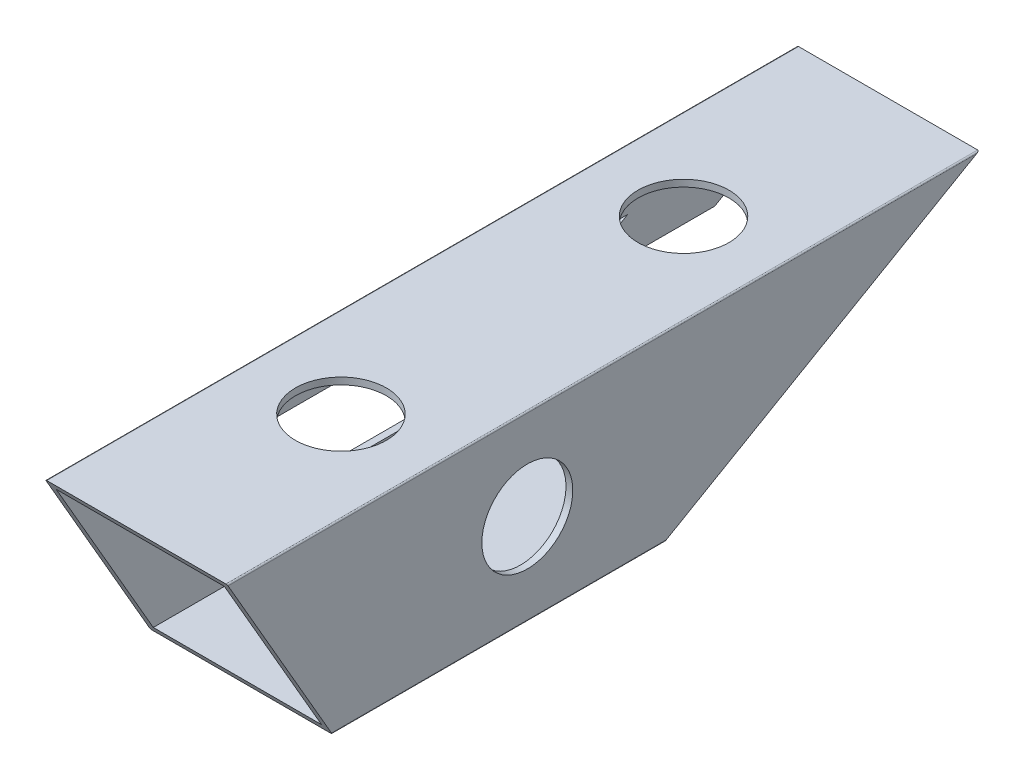
ISO-10303-21;
HEADER;
FILE_DESCRIPTION(('STEP AP214'),'2;1');
FILE_NAME('part.step','',(''),(''),'','','');
FILE_SCHEMA(('AUTOMOTIVE_DESIGN { 1 0 10303 214 1 1 1 1 }'));
ENDSEC;
DATA;
#1=APPLICATION_CONTEXT('core data for automotive mechanical design processes');
#2=APPLICATION_PROTOCOL_DEFINITION('international standard','automotive_design',2000,#1);
#3=PRODUCT_CONTEXT('',#1,'mechanical');
#4=PRODUCT('Part','Part','',(#3));
#5=PRODUCT_RELATED_PRODUCT_CATEGORY('part','',(#4));
#6=PRODUCT_DEFINITION_FORMATION('','',#4);
#7=PRODUCT_DEFINITION_CONTEXT('part definition',#1,'design');
#8=PRODUCT_DEFINITION('design','',#6,#7);
#9=PRODUCT_DEFINITION_SHAPE('','',#8);
#10=(LENGTH_UNIT() NAMED_UNIT(*) SI_UNIT(.MILLI.,.METRE.));
#11=(NAMED_UNIT(*) PLANE_ANGLE_UNIT() SI_UNIT($,.RADIAN.));
#12=(NAMED_UNIT(*) SI_UNIT($,.STERADIAN.) SOLID_ANGLE_UNIT());
#13=UNCERTAINTY_MEASURE_WITH_UNIT(LENGTH_MEASURE(1.E-05),#10,'distance_accuracy_value','');
#14=(GEOMETRIC_REPRESENTATION_CONTEXT(3) GLOBAL_UNCERTAINTY_ASSIGNED_CONTEXT((#13)) GLOBAL_UNIT_ASSIGNED_CONTEXT((#10,
#11,#12)) REPRESENTATION_CONTEXT('',''));
#15=CARTESIAN_POINT('',(0.,0.,0.));
#16=DIRECTION('',(0.,0.,1.));
#17=DIRECTION('',(1.,0.,0.));
#18=AXIS2_PLACEMENT_3D('',#15,#16,#17);
#19=CARTESIAN_POINT('',(1.5,1.5,165.35));
#20=DIRECTION('',(1.,0.,0.));
#21=DIRECTION('',(0.,0.,-1.));
#22=AXIS2_PLACEMENT_3D('',#19,#20,#21);
#23=PLANE('',#22);
#24=DIRECTION('',(0.,-0.500000000000004,0.866025403784436));
#25=VECTOR('',#24,1.);
#26=CARTESIAN_POINT('',(1.5,-41.223650257879,140.68348902285));
#27=LINE('',#26,#25);
#28=CARTESIAN_POINT('',(1.5,38.5,2.59807621135327));
#29=VERTEX_POINT('',#28);
#30=CARTESIAN_POINT('',(1.5,30.0000000000004,17.3205080756879));
#31=VERTEX_POINT('',#30);
#32=EDGE_CURVE('E333',#29,#31,#27,.T.);
#33=ORIENTED_EDGE('',*,*,#32,.F.);
#34=DIRECTION('',(0.,0.,-1.));
#35=VECTOR('',#34,1.);
#36=CARTESIAN_POINT('',(1.5,38.5,165.35));
#37=LINE('',#36,#35);
#38=CARTESIAN_POINT('',(1.5,38.5,164.483974596216));
#39=VERTEX_POINT('',#38);
#40=EDGE_CURVE('E352',#39,#29,#37,.T.);
#41=ORIENTED_EDGE('',*,*,#40,.F.);
#42=DIRECTION('',(0.,0.866025403784442,0.499999999999995));
#43=VECTOR('',#42,1.);
#44=CARTESIAN_POINT('',(1.5,11.1249999999998,148.67901097715));
#45=LINE('',#44,#43);
#46=CARTESIAN_POINT('',(1.5,1.5,143.1220146362));
#47=VERTEX_POINT('',#46);
#48=EDGE_CURVE('E309',#47,#39,#45,.T.);
#49=ORIENTED_EDGE('',*,*,#48,.F.);
#50=DIRECTION('',(0.,0.,-1.));
#51=VECTOR('',#50,1.);
#52=CARTESIAN_POINT('',(1.5,1.5,165.35));
#53=LINE('',#52,#51);
#54=CARTESIAN_POINT('',(1.5,1.5,66.683956091401));
#55=VERTEX_POINT('',#54);
#56=EDGE_CURVE('E361',#47,#55,#53,.T.);
#57=ORIENTED_EDGE('',*,*,#56,.T.);
#58=CARTESIAN_POINT('',(1.5,20.,34.6410161513772));
#59=VERTEX_POINT('',#58);
#60=EDGE_CURVE('E332',#59,#55,#27,.T.);
#61=ORIENTED_EDGE('',*,*,#60,.F.);
#62=DIRECTION('',(0.,0.,1.));
#63=VECTOR('',#62,1.);
#64=CARTESIAN_POINT('',(1.5,20.0000000000003,19.641016151377));
#65=LINE('',#64,#63);
#66=CARTESIAN_POINT('',(1.5,20.0000000000003,19.641016151377));
#67=VERTEX_POINT('',#66);
#68=EDGE_CURVE('E250',#67,#59,#65,.T.);
#69=ORIENTED_EDGE('',*,*,#68,.F.);
#70=DIRECTION('',(0.,-0.5,0.866025403784439));
#71=VECTOR('',#70,1.);
#72=CARTESIAN_POINT('',(1.5,30.0000000000004,2.32050807568812));
#73=LINE('',#72,#71);
#74=CARTESIAN_POINT('',(1.5,30.0000000000004,2.32050807568812));
#75=VERTEX_POINT('',#74);
#76=EDGE_CURVE('E246',#75,#67,#73,.T.);
#77=ORIENTED_EDGE('',*,*,#76,.F.);
#78=DIRECTION('',(0.,0.,-1.));
#79=VECTOR('',#78,1.);
#80=CARTESIAN_POINT('',(1.5,30.0000000000004,17.3205080756879));
#81=LINE('',#80,#79);
#82=EDGE_CURVE('E243',#31,#75,#81,.T.);
#83=ORIENTED_EDGE('',*,*,#82,.F.);
#84=EDGE_LOOP('',(#33,#41,#49,#57,#61,#69,#77,#83));
#85=FACE_BOUND('',#84,.T.);
#86=DIRECTION('',(0.,0.866025403784439,0.5));
#87=VECTOR('',#86,1.);
#88=CARTESIAN_POINT('',(1.5,18.6249999999999,135.688629920383));
#89=LINE('',#88,#87);
#90=CARTESIAN_POINT('',(1.5,12.,131.863684387002));
#91=VERTEX_POINT('',#90);
#92=CARTESIAN_POINT('',(1.5,28.,141.101288694036));
#93=VERTEX_POINT('',#92);
#94=EDGE_CURVE('E239',#91,#93,#89,.T.);
#95=ORIENTED_EDGE('',*,*,#94,.T.);
#96=DIRECTION('',(0.,0.,-1.));
#97=VECTOR('',#96,1.);
#98=CARTESIAN_POINT('',(1.5,28.,165.35));
#99=LINE('',#98,#97);
#100=CARTESIAN_POINT('',(1.5,28.,38.7846096908265));
#101=VERTEX_POINT('',#100);
#102=EDGE_CURVE('E203',#93,#101,#99,.T.);
#103=ORIENTED_EDGE('',*,*,#102,.T.);
#104=DIRECTION('',(0.,-0.5,0.866025403784439));
#105=VECTOR('',#104,1.);
#106=CARTESIAN_POINT('',(1.5,-33.4294216238185,145.18348902285));
#107=LINE('',#106,#105);
#108=CARTESIAN_POINT('',(1.5,12.,66.4974226119286));
#109=VERTEX_POINT('',#108);
#110=EDGE_CURVE('E206',#101,#109,#107,.T.);
#111=ORIENTED_EDGE('',*,*,#110,.T.);
#112=DIRECTION('',(0.,0.,1.));
#113=VECTOR('',#112,1.);
#114=CARTESIAN_POINT('',(1.5,12.,165.35));
#115=LINE('',#114,#113);
#116=EDGE_CURVE('E236',#109,#91,#115,.T.);
#117=ORIENTED_EDGE('',*,*,#116,.T.);
#118=EDGE_LOOP('',(#95,#103,#111,#117));
#119=FACE_BOUND('',#118,.T.);
#120=ADVANCED_FACE('F39',(#85,#119),#23,.T.);
#121=CARTESIAN_POINT('',(0.,0.305025041444909,165.35));
#122=DIRECTION('',(1.,0.,0.));
#123=DIRECTION('',(0.,0.,-1.));
#124=AXIS2_PLACEMENT_3D('',#121,#122,#123);
#125=PLANE('',#124);
#126=DIRECTION('',(0.,0.,-1.));
#127=VECTOR('',#126,1.);
#128=CARTESIAN_POINT('',(0.,39.6949749585551,165.35));
#129=LINE('',#128,#127);
#130=CARTESIAN_POINT('',(0.,39.6949749585551,165.173893710212));
#131=VERTEX_POINT('',#130);
#132=CARTESIAN_POINT('',(0.,39.6949749585551,0.528318869363359));
#133=VERTEX_POINT('',#132);
#134=EDGE_CURVE('E390',#131,#133,#129,.T.);
#135=ORIENTED_EDGE('',*,*,#134,.T.);
#136=DIRECTION('',(0.,-0.500000000000004,0.866025403784436));
#137=VECTOR('',#136,1.);
#138=CARTESIAN_POINT('',(0.,-41.5223939975178,141.200928358347));
#139=LINE('',#138,#137);
#140=CARTESIAN_POINT('',(0.,30.0000000000004,17.3205080756879));
#141=VERTEX_POINT('',#140);
#142=EDGE_CURVE('E346',#133,#141,#139,.T.);
#143=ORIENTED_EDGE('',*,*,#142,.T.);
#144=DIRECTION('',(0.,0.,-1.));
#145=VECTOR('',#144,1.);
#146=CARTESIAN_POINT('',(0.,30.0000000000004,17.3205080756879));
#147=LINE('',#146,#145);
#148=CARTESIAN_POINT('',(0.,30.0000000000004,2.32050807568812));
#149=VERTEX_POINT('',#148);
#150=EDGE_CURVE('E242',#141,#149,#147,.T.);
#151=ORIENTED_EDGE('',*,*,#150,.T.);
#152=DIRECTION('',(0.,-0.5,0.866025403784439));
#153=VECTOR('',#152,1.);
#154=CARTESIAN_POINT('',(0.,30.0000000000004,2.32050807568812));
#155=LINE('',#154,#153);
#156=CARTESIAN_POINT('',(0.,20.0000000000003,19.641016151377));
#157=VERTEX_POINT('',#156);
#158=EDGE_CURVE('E255',#149,#157,#155,.T.);
#159=ORIENTED_EDGE('',*,*,#158,.T.);
#160=DIRECTION('',(0.,0.,1.));
#161=VECTOR('',#160,1.);
#162=CARTESIAN_POINT('',(0.,20.0000000000003,19.641016151377));
#163=LINE('',#162,#161);
#164=CARTESIAN_POINT('',(0.,20.,34.6410161513772));
#165=VERTEX_POINT('',#164);
#166=EDGE_CURVE('E247',#157,#165,#163,.T.);
#167=ORIENTED_EDGE('',*,*,#166,.T.);
#168=CARTESIAN_POINT('',(0.,0.305025041444909,68.753713433391));
#169=VERTEX_POINT('',#168);
#170=EDGE_CURVE('E345',#165,#169,#139,.T.);
#171=ORIENTED_EDGE('',*,*,#170,.T.);
#172=DIRECTION('',(0.,0.,-1.));
#173=VECTOR('',#172,1.);
#174=CARTESIAN_POINT('',(0.,0.305025041444909,165.35));
#175=LINE('',#174,#173);
#176=CARTESIAN_POINT('',(0.,0.305025041444909,142.432095522203));
#177=VERTEX_POINT('',#176);
#178=EDGE_CURVE('E387',#177,#169,#175,.T.);
#179=ORIENTED_EDGE('',*,*,#178,.F.);
#180=DIRECTION('',(0.,0.866025403784442,0.499999999999995));
#181=VECTOR('',#180,1.);
#182=CARTESIAN_POINT('',(0.,10.2287687810835,148.161571641652));
#183=LINE('',#182,#181);
#184=EDGE_CURVE('E320',#177,#131,#183,.T.);
#185=ORIENTED_EDGE('',*,*,#184,.T.);
#186=EDGE_LOOP('',(#135,#143,#151,#159,#167,#171,#179,#185));
#187=FACE_BOUND('',#186,.T.);
#188=DIRECTION('',(0.,0.,1.));
#189=VECTOR('',#188,1.);
#190=CARTESIAN_POINT('',(0.,28.,141.101288694036));
#191=LINE('',#190,#189);
#192=CARTESIAN_POINT('',(0.,28.,38.7846096908265));
#193=VERTEX_POINT('',#192);
#194=CARTESIAN_POINT('',(0.,28.,141.101288694036));
#195=VERTEX_POINT('',#194);
#196=EDGE_CURVE('E63',#193,#195,#191,.T.);
#197=ORIENTED_EDGE('',*,*,#196,.T.);
#198=DIRECTION('',(0.,-0.866025403784438,-0.5));
#199=VECTOR('',#198,1.);
#200=CARTESIAN_POINT('',(0.,12.,131.863684387002));
#201=LINE('',#200,#199);
#202=CARTESIAN_POINT('',(0.,12.,131.863684387002));
#203=VERTEX_POINT('',#202);
#204=EDGE_CURVE('E210',#195,#203,#201,.T.);
#205=ORIENTED_EDGE('',*,*,#204,.T.);
#206=DIRECTION('',(0.,0.,-1.));
#207=VECTOR('',#206,1.);
#208=CARTESIAN_POINT('',(0.,12.,66.4974226119286));
#209=LINE('',#208,#207);
#210=CARTESIAN_POINT('',(0.,12.,66.4974226119286));
#211=VERTEX_POINT('',#210);
#212=EDGE_CURVE('E216',#203,#211,#209,.T.);
#213=ORIENTED_EDGE('',*,*,#212,.T.);
#214=DIRECTION('',(0.,0.5,-0.866025403784439));
#215=VECTOR('',#214,1.);
#216=CARTESIAN_POINT('',(0.,28.,38.7846096908265));
#217=LINE('',#216,#215);
#218=EDGE_CURVE('E220',#211,#193,#217,.T.);
#219=ORIENTED_EDGE('',*,*,#218,.T.);
#220=EDGE_LOOP('',(#197,#205,#213,#219));
#221=FACE_BOUND('',#220,.T.);
#222=ADVANCED_FACE('F219',(#187,#221),#125,.F.);
#223=CARTESIAN_POINT('',(-9.99999999999999,40.,0.));
#224=DIRECTION('',(0.,0.866025403784436,0.500000000000004));
#225=DIRECTION('',(0.,-0.500000000000004,0.866025403784436));
#226=AXIS2_PLACEMENT_3D('',#223,#224,#225);
#227=PLANE('',#226);
#228=ORIENTED_EDGE('',*,*,#32,.T.);
#229=DIRECTION('',(-1.,0.,0.));
#230=VECTOR('',#229,1.);
#231=CARTESIAN_POINT('',(1.5,30.0000000000004,17.3205080756879));
#232=LINE('',#231,#230);
#233=EDGE_CURVE('E259',#31,#141,#232,.T.);
#234=ORIENTED_EDGE('',*,*,#233,.T.);
#235=ORIENTED_EDGE('',*,*,#142,.F.);
#236=CARTESIAN_POINT('',(0.305025041444907,39.6949749585551,0.528318869363359));
#237=DIRECTION('',(0.,0.866025403784436,0.500000000000004));
#238=DIRECTION('',(0.,0.500000000000004,-0.866025403784436));
#239=AXIS2_PLACEMENT_3D('',#236,#237,#238);
#240=ELLIPSE('',#239,0.610050082889805,0.305025041444905);
#241=CARTESIAN_POINT('',(0.305025041444909,40.,0.));
#242=VERTEX_POINT('',#241);
#243=EDGE_CURVE('E349',#242,#133,#240,.T.);
#244=ORIENTED_EDGE('',*,*,#243,.F.);
#245=DIRECTION('',(-1.,0.,0.));
#246=VECTOR('',#245,1.);
#247=CARTESIAN_POINT('',(0.305025041444909,40.,0.));
#248=LINE('',#247,#246);
#249=CARTESIAN_POINT('',(39.6949749585551,40.,0.));
#250=VERTEX_POINT('',#249);
#251=EDGE_CURVE('E364',#250,#242,#248,.T.);
#252=ORIENTED_EDGE('',*,*,#251,.F.);
#253=CARTESIAN_POINT('',(39.6949749585551,39.6949749585551,0.528318869363387));
#254=DIRECTION('',(0.,0.866025403784436,0.500000000000004));
#255=DIRECTION('',(0.,0.500000000000004,-0.866025403784436));
#256=AXIS2_PLACEMENT_3D('',#253,#254,#255);
#257=ELLIPSE('',#256,0.610050082889802,0.305025041444903);
#258=CARTESIAN_POINT('',(40.,39.6949749585551,0.528318869363388));
#259=VERTEX_POINT('',#258);
#260=EDGE_CURVE('E336',#259,#250,#257,.T.);
#261=ORIENTED_EDGE('',*,*,#260,.F.);
#262=DIRECTION('',(0.,-0.500000000000004,0.866025403784436));
#263=VECTOR('',#262,1.);
#264=CARTESIAN_POINT('',(40.,40.,0.));
#265=LINE('',#264,#263);
#266=CARTESIAN_POINT('',(40.,0.30502504144491,68.7537134333909));
#267=VERTEX_POINT('',#266);
#268=EDGE_CURVE('E296',#259,#267,#265,.T.);
#269=ORIENTED_EDGE('',*,*,#268,.T.);
#270=CARTESIAN_POINT('',(39.6949749585551,0.305025041444907,68.753713433391));
#271=DIRECTION('',(0.,0.866025403784436,0.500000000000004));
#272=DIRECTION('',(0.,0.500000000000004,-0.866025403784436));
#273=AXIS2_PLACEMENT_3D('',#270,#271,#272);
#274=ELLIPSE('',#273,0.610050082889805,0.305025041444905);
#275=CARTESIAN_POINT('',(39.6949749585551,0.,69.2820323027543));
#276=VERTEX_POINT('',#275);
#277=EDGE_CURVE('E339',#276,#267,#274,.T.);
#278=ORIENTED_EDGE('',*,*,#277,.F.);
#279=DIRECTION('',(1.,0.,0.));
#280=VECTOR('',#279,1.);
#281=CARTESIAN_POINT('',(-9.99999999999999,0.,69.2820323027543));
#282=LINE('',#281,#280);
#283=CARTESIAN_POINT('',(30.,0.,69.2820323027543));
#284=VERTEX_POINT('',#283);
#285=EDGE_CURVE('E298',#284,#276,#282,.T.);
#286=ORIENTED_EDGE('',*,*,#285,.F.);
#287=DIRECTION('',(0.,0.500000000000108,-0.866025403784376));
#288=VECTOR('',#287,1.);
#289=CARTESIAN_POINT('',(30.,1.5,66.6839560914018));
#290=LINE('',#289,#288);
#291=CARTESIAN_POINT('',(30.,1.5,66.683956091401));
#292=VERTEX_POINT('',#291);
#293=EDGE_CURVE('E269',#284,#292,#290,.T.);
#294=ORIENTED_EDGE('',*,*,#293,.T.);
#295=DIRECTION('',(1.,0.,0.));
#296=VECTOR('',#295,1.);
#297=CARTESIAN_POINT('',(1.5,1.5,66.683956091401));
#298=LINE('',#297,#296);
#299=CARTESIAN_POINT('',(38.5,1.5,66.683956091401));
#300=VERTEX_POINT('',#299);
#301=EDGE_CURVE('E328',#292,#300,#298,.T.);
#302=ORIENTED_EDGE('',*,*,#301,.T.);
#303=DIRECTION('',(0.,0.500000000000004,-0.866025403784436));
#304=VECTOR('',#303,1.);
#305=CARTESIAN_POINT('',(38.5,-41.223650257879,140.68348902285));
#306=LINE('',#305,#304);
#307=CARTESIAN_POINT('',(38.5,38.5,2.59807621135327));
#308=VERTEX_POINT('',#307);
#309=EDGE_CURVE('E326',#300,#308,#306,.T.);
#310=ORIENTED_EDGE('',*,*,#309,.T.);
#311=DIRECTION('',(-1.,0.,0.));
#312=VECTOR('',#311,1.);
#313=CARTESIAN_POINT('',(1.5,38.5,2.59807621135327));
#314=LINE('',#313,#312);
#315=EDGE_CURVE('E11',#308,#29,#314,.T.);
#316=ORIENTED_EDGE('',*,*,#315,.T.);
#317=EDGE_LOOP('',(#228,#234,#235,#244,#252,#261,#269,#278,#286,#294,#302,#310,#316));
#318=FACE_BOUND('',#317,.T.);
#319=ADVANCED_FACE('F411',(#318),#227,.F.);
#320=ORIENTED_EDGE('',*,*,#170,.F.);
#321=DIRECTION('',(-1.,0.,0.));
#322=VECTOR('',#321,1.);
#323=CARTESIAN_POINT('',(1.5,20.,34.6410161513772));
#324=LINE('',#323,#322);
#325=EDGE_CURVE('E263',#59,#165,#324,.T.);
#326=ORIENTED_EDGE('',*,*,#325,.F.);
#327=ORIENTED_EDGE('',*,*,#60,.T.);
#328=CARTESIAN_POINT('',(10.,1.5,66.6839560914018));
#329=VERTEX_POINT('',#328);
#330=EDGE_CURVE('E329',#55,#329,#298,.T.);
#331=ORIENTED_EDGE('',*,*,#330,.T.);
#332=DIRECTION('',(0.,0.500000000000108,-0.866025403784376));
#333=VECTOR('',#332,1.);
#334=CARTESIAN_POINT('',(10.,1.5,66.6839560914018));
#335=LINE('',#334,#333);
#336=CARTESIAN_POINT('',(10.,0.,69.2820323027543));
#337=VERTEX_POINT('',#336);
#338=EDGE_CURVE('E262',#337,#329,#335,.T.);
#339=ORIENTED_EDGE('',*,*,#338,.F.);
#340=CARTESIAN_POINT('',(0.305025041444909,0.,69.2820323027543));
#341=VERTEX_POINT('',#340);
#342=EDGE_CURVE('E300',#341,#337,#282,.T.);
#343=ORIENTED_EDGE('',*,*,#342,.F.);
#344=CARTESIAN_POINT('',(0.305025041444907,0.305025041444907,68.753713433391));
#345=DIRECTION('',(0.,0.866025403784436,0.500000000000004));
#346=DIRECTION('',(0.,0.500000000000004,-0.866025403784436));
#347=AXIS2_PLACEMENT_3D('',#344,#345,#346);
#348=ELLIPSE('',#347,0.610050082889808,0.305025041444907);
#349=EDGE_CURVE('E342',#169,#341,#348,.T.);
#350=ORIENTED_EDGE('',*,*,#349,.F.);
#351=EDGE_LOOP('',(#320,#326,#327,#331,#339,#343,#350));
#352=FACE_BOUND('',#351,.T.);
#353=ADVANCED_FACE('F460',(#352),#227,.F.);
#354=CARTESIAN_POINT('',(1.5,38.5,165.35));
#355=DIRECTION('',(0.,-1.,0.));
#356=DIRECTION('',(0.,0.,-1.));
#357=AXIS2_PLACEMENT_3D('',#354,#355,#356);
#358=PLANE('',#357);
#359=CARTESIAN_POINT('',(20.,38.5,120.35));
#360=DIRECTION('',(0.,-1.,0.));
#361=DIRECTION('',(0.,0.,-1.));
#362=AXIS2_PLACEMENT_3D('',#359,#360,#361);
#363=CIRCLE('',#362,10.);
#364=CARTESIAN_POINT('',(20.,38.5,110.35));
#365=VERTEX_POINT('',#364);
#366=EDGE_CURVE('E221',#365,#365,#363,.T.);
#367=ORIENTED_EDGE('',*,*,#366,.F.);
#368=EDGE_LOOP('',(#367));
#369=FACE_BOUND('',#368,.T.);
#370=CARTESIAN_POINT('',(20.,38.5,45.));
#371=DIRECTION('',(0.,-1.,0.));
#372=DIRECTION('',(0.,0.,-1.));
#373=AXIS2_PLACEMENT_3D('',#370,#371,#372);
#374=CIRCLE('',#373,10.);
#375=CARTESIAN_POINT('',(20.,38.5,35.));
#376=VERTEX_POINT('',#375);
#377=EDGE_CURVE('E224',#376,#376,#374,.T.);
#378=ORIENTED_EDGE('',*,*,#377,.F.);
#379=EDGE_LOOP('',(#378));
#380=FACE_BOUND('',#379,.T.);
#381=ORIENTED_EDGE('',*,*,#315,.F.);
#382=DIRECTION('',(0.,0.,-1.));
#383=VECTOR('',#382,1.);
#384=CARTESIAN_POINT('',(38.5,38.5,165.35));
#385=LINE('',#384,#383);
#386=CARTESIAN_POINT('',(38.5,38.5,164.483974596216));
#387=VERTEX_POINT('',#386);
#388=EDGE_CURVE('E355',#387,#308,#385,.T.);
#389=ORIENTED_EDGE('',*,*,#388,.F.);
#390=DIRECTION('',(1.,0.,0.));
#391=VECTOR('',#390,1.);
#392=CARTESIAN_POINT('',(1.5,38.5,164.483974596216));
#393=LINE('',#392,#391);
#394=EDGE_CURVE('E48',#39,#387,#393,.T.);
#395=ORIENTED_EDGE('',*,*,#394,.F.);
#396=ORIENTED_EDGE('',*,*,#40,.T.);
#397=EDGE_LOOP('',(#381,#389,#395,#396));
#398=FACE_BOUND('',#397,.T.);
#399=ADVANCED_FACE('F408',(#369,#380,#398),#358,.T.);
#400=CARTESIAN_POINT('',(38.5,1.5,165.35));
#401=DIRECTION('',(-1.,0.,0.));
#402=DIRECTION('',(0.,0.,1.));
#403=AXIS2_PLACEMENT_3D('',#400,#401,#402);
#404=PLANE('',#403);
#405=CARTESIAN_POINT('',(38.5,20.,99.35));
#406=DIRECTION('',(-1.,0.,0.));
#407=DIRECTION('',(0.,0.,1.));
#408=AXIS2_PLACEMENT_3D('',#405,#406,#407);
#409=CIRCLE('',#408,9.99999999999999);
#410=CARTESIAN_POINT('',(38.5,20.,109.35));
#411=VERTEX_POINT('',#410);
#412=EDGE_CURVE('E526',#411,#411,#409,.T.);
#413=ORIENTED_EDGE('',*,*,#412,.F.);
#414=EDGE_LOOP('',(#413));
#415=FACE_BOUND('',#414,.T.);
#416=ORIENTED_EDGE('',*,*,#309,.F.);
#417=DIRECTION('',(0.,0.,-1.));
#418=VECTOR('',#417,1.);
#419=CARTESIAN_POINT('',(38.5,1.5,165.35));
#420=LINE('',#419,#418);
#421=CARTESIAN_POINT('',(38.5,1.5,143.1220146362));
#422=VERTEX_POINT('',#421);
#423=EDGE_CURVE('E358',#422,#300,#420,.T.);
#424=ORIENTED_EDGE('',*,*,#423,.F.);
#425=DIRECTION('',(0.,-0.866025403784442,-0.499999999999995));
#426=VECTOR('',#425,1.);
#427=CARTESIAN_POINT('',(38.5,11.1249999999998,148.67901097715));
#428=LINE('',#427,#426);
#429=EDGE_CURVE('E303',#387,#422,#428,.T.);
#430=ORIENTED_EDGE('',*,*,#429,.F.);
#431=ORIENTED_EDGE('',*,*,#388,.T.);
#432=EDGE_LOOP('',(#416,#424,#430,#431));
#433=FACE_BOUND('',#432,.T.);
#434=ADVANCED_FACE('F406',(#415,#433),#404,.T.);
#435=CARTESIAN_POINT('',(1.5,1.5,165.35));
#436=DIRECTION('',(0.,1.,0.));
#437=DIRECTION('',(0.,0.,1.));
#438=AXIS2_PLACEMENT_3D('',#435,#436,#437);
#439=PLANE('',#438);
#440=ORIENTED_EDGE('',*,*,#330,.F.);
#441=ORIENTED_EDGE('',*,*,#56,.F.);
#442=DIRECTION('',(-1.,0.,0.));
#443=VECTOR('',#442,1.);
#444=CARTESIAN_POINT('',(1.5,1.5,143.1220146362));
#445=LINE('',#444,#443);
#446=EDGE_CURVE('E307',#422,#47,#445,.T.);
#447=ORIENTED_EDGE('',*,*,#446,.F.);
#448=ORIENTED_EDGE('',*,*,#423,.T.);
#449=ORIENTED_EDGE('',*,*,#301,.F.);
#450=DIRECTION('',(0.,0.,-1.));
#451=VECTOR('',#450,1.);
#452=CARTESIAN_POINT('',(30.,1.5,52.2820323027543));
#453=LINE('',#452,#451);
#454=CARTESIAN_POINT('',(30.,1.5,52.2820323027543));
#455=VERTEX_POINT('',#454);
#456=EDGE_CURVE('E272',#292,#455,#453,.T.);
#457=ORIENTED_EDGE('',*,*,#456,.T.);
#458=DIRECTION('',(-1.,0.,0.));
#459=VECTOR('',#458,1.);
#460=CARTESIAN_POINT('',(30.,1.5,52.2820323027543));
#461=LINE('',#460,#459);
#462=CARTESIAN_POINT('',(10.,1.5,52.2820323027543));
#463=VERTEX_POINT('',#462);
#464=EDGE_CURVE('E282',#455,#463,#461,.T.);
#465=ORIENTED_EDGE('',*,*,#464,.T.);
#466=DIRECTION('',(0.,0.,-1.));
#467=VECTOR('',#466,1.);
#468=CARTESIAN_POINT('',(10.,1.5,52.2820323027543));
#469=LINE('',#468,#467);
#470=EDGE_CURVE('E285',#329,#463,#469,.T.);
#471=ORIENTED_EDGE('',*,*,#470,.F.);
#472=EDGE_LOOP('',(#440,#441,#447,#448,#449,#457,#465,#471));
#473=FACE_BOUND('',#472,.T.);
#474=ADVANCED_FACE('F453',(#473),#439,.T.);
#475=CARTESIAN_POINT('',(-9.99999999999999,40.,165.35));
#476=DIRECTION('',(0.,0.499999999999995,-0.866025403784442));
#477=DIRECTION('',(0.,0.866025403784442,0.499999999999995));
#478=AXIS2_PLACEMENT_3D('',#475,#476,#477);
#479=PLANE('',#478);
#480=ORIENTED_EDGE('',*,*,#48,.T.);
#481=ORIENTED_EDGE('',*,*,#394,.T.);
#482=ORIENTED_EDGE('',*,*,#429,.T.);
#483=ORIENTED_EDGE('',*,*,#446,.T.);
#484=EDGE_LOOP('',(#480,#481,#482,#483));
#485=FACE_BOUND('',#484,.T.);
#486=ORIENTED_EDGE('',*,*,#184,.F.);
#487=CARTESIAN_POINT('',(0.305025041444907,0.305025041444907,142.432095522203));
#488=DIRECTION('',(0.,0.499999999999995,-0.866025403784442));
#489=DIRECTION('',(0.,-0.866025403784442,-0.499999999999995));
#490=AXIS2_PLACEMENT_3D('',#487,#488,#489);
#491=ELLIPSE('',#490,0.352212579575586,0.305025041444907);
#492=CARTESIAN_POINT('',(0.305025041444909,0.,142.255989232415));
#493=VERTEX_POINT('',#492);
#494=EDGE_CURVE('E317',#493,#177,#491,.T.);
#495=ORIENTED_EDGE('',*,*,#494,.F.);
#496=DIRECTION('',(1.,0.,0.));
#497=VECTOR('',#496,1.);
#498=CARTESIAN_POINT('',(-9.99999999999999,0.,142.255989232415));
#499=LINE('',#498,#497);
#500=CARTESIAN_POINT('',(39.6949749585551,0.,142.255989232415));
#501=VERTEX_POINT('',#500);
#502=EDGE_CURVE('E299',#493,#501,#499,.T.);
#503=ORIENTED_EDGE('',*,*,#502,.T.);
#504=CARTESIAN_POINT('',(39.6949749585551,0.305025041444907,142.432095522203));
#505=DIRECTION('',(0.,0.499999999999995,-0.866025403784442));
#506=DIRECTION('',(0.,-0.866025403784442,-0.499999999999995));
#507=AXIS2_PLACEMENT_3D('',#504,#505,#506);
#508=ELLIPSE('',#507,0.352212579575584,0.305025041444905);
#509=CARTESIAN_POINT('',(40.,0.305025041444917,142.432095522203));
#510=VERTEX_POINT('',#509);
#511=EDGE_CURVE('E314',#510,#501,#508,.T.);
#512=ORIENTED_EDGE('',*,*,#511,.F.);
#513=DIRECTION('',(0.,0.866025403784442,0.499999999999995));
#514=VECTOR('',#513,1.);
#515=CARTESIAN_POINT('',(40.,40.,165.35));
#516=LINE('',#515,#514);
#517=CARTESIAN_POINT('',(40.,39.6949749585551,165.173893710212));
#518=VERTEX_POINT('',#517);
#519=EDGE_CURVE('E294',#510,#518,#516,.T.);
#520=ORIENTED_EDGE('',*,*,#519,.T.);
#521=CARTESIAN_POINT('',(39.6949749585551,39.6949749585551,165.173893710212));
#522=DIRECTION('',(0.,0.499999999999995,-0.866025403784442));
#523=DIRECTION('',(0.,-0.866025403784442,-0.499999999999995));
#524=AXIS2_PLACEMENT_3D('',#521,#522,#523);
#525=ELLIPSE('',#524,0.352212579575582,0.305025041444903);
#526=CARTESIAN_POINT('',(39.6949749585551,40.,165.35));
#527=VERTEX_POINT('',#526);
#528=EDGE_CURVE('E311',#527,#518,#525,.T.);
#529=ORIENTED_EDGE('',*,*,#528,.F.);
#530=DIRECTION('',(-1.,0.,0.));
#531=VECTOR('',#530,1.);
#532=CARTESIAN_POINT('',(0.305025041444909,40.,165.35));
#533=LINE('',#532,#531);
#534=CARTESIAN_POINT('',(0.305025041444909,40.,165.35));
#535=VERTEX_POINT('',#534);
#536=EDGE_CURVE('E365',#527,#535,#533,.T.);
#537=ORIENTED_EDGE('',*,*,#536,.T.);
#538=CARTESIAN_POINT('',(0.305025041444907,39.6949749585551,165.173893710212));
#539=DIRECTION('',(0.,0.499999999999995,-0.866025403784442));
#540=DIRECTION('',(0.,-0.866025403784442,-0.499999999999995));
#541=AXIS2_PLACEMENT_3D('',#538,#539,#540);
#542=ELLIPSE('',#541,0.352212579575584,0.305025041444905);
#543=EDGE_CURVE('E323',#131,#535,#542,.T.);
#544=ORIENTED_EDGE('',*,*,#543,.F.);
#545=EDGE_LOOP('',(#486,#495,#503,#512,#520,#529,#537,#544));
#546=FACE_BOUND('',#545,.T.);
#547=ADVANCED_FACE('F396',(#485,#546),#479,.F.);
#548=CARTESIAN_POINT('',(0.305025041444907,39.6949749585551,165.35));
#549=DIRECTION('',(0.,0.,-1.));
#550=DIRECTION('',(-1.,0.,0.));
#551=AXIS2_PLACEMENT_3D('',#548,#549,#550);
#552=CYLINDRICAL_SURFACE('',#551,0.305025041444905);
#553=DIRECTION('',(0.,0.,-1.));
#554=VECTOR('',#553,1.);
#555=CARTESIAN_POINT('',(0.305025041444909,40.,165.35));
#556=LINE('',#555,#554);
#557=EDGE_CURVE('E367',#535,#242,#556,.T.);
#558=ORIENTED_EDGE('',*,*,#557,.T.);
#559=ORIENTED_EDGE('',*,*,#243,.T.);
#560=ORIENTED_EDGE('',*,*,#134,.F.);
#561=ORIENTED_EDGE('',*,*,#543,.T.);
#562=EDGE_LOOP('',(#558,#559,#560,#561));
#563=FACE_BOUND('',#562,.T.);
#564=ADVANCED_FACE('F41',(#563),#552,.T.);
#565=CARTESIAN_POINT('',(0.305025041444907,0.305025041444907,165.35));
#566=DIRECTION('',(0.,0.,-1.));
#567=DIRECTION('',(-1.,0.,0.));
#568=AXIS2_PLACEMENT_3D('',#565,#566,#567);
#569=CYLINDRICAL_SURFACE('',#568,0.305025041444907);
#570=ORIENTED_EDGE('',*,*,#178,.T.);
#571=ORIENTED_EDGE('',*,*,#349,.T.);
#572=DIRECTION('',(0.,0.,-1.));
#573=VECTOR('',#572,1.);
#574=CARTESIAN_POINT('',(0.305025041444909,0.,165.35));
#575=LINE('',#574,#573);
#576=EDGE_CURVE('E384',#493,#341,#575,.T.);
#577=ORIENTED_EDGE('',*,*,#576,.F.);
#578=ORIENTED_EDGE('',*,*,#494,.T.);
#579=EDGE_LOOP('',(#570,#571,#577,#578));
#580=FACE_BOUND('',#579,.T.);
#581=ADVANCED_FACE('F467',(#580),#569,.T.);
#582=CARTESIAN_POINT('',(0.305025041444909,0.,165.35));
#583=DIRECTION('',(0.,1.,0.));
#584=DIRECTION('',(0.,0.,1.));
#585=AXIS2_PLACEMENT_3D('',#582,#583,#584);
#586=PLANE('',#585);
#587=ORIENTED_EDGE('',*,*,#576,.T.);
#588=ORIENTED_EDGE('',*,*,#342,.T.);
#589=DIRECTION('',(0.,0.,1.));
#590=VECTOR('',#589,1.);
#591=CARTESIAN_POINT('',(10.,0.,69.2820323027543));
#592=LINE('',#591,#590);
#593=CARTESIAN_POINT('',(10.,0.,52.2820323027543));
#594=VERTEX_POINT('',#593);
#595=EDGE_CURVE('E273',#594,#337,#592,.T.);
#596=ORIENTED_EDGE('',*,*,#595,.F.);
#597=DIRECTION('',(-1.,0.,0.));
#598=VECTOR('',#597,1.);
#599=CARTESIAN_POINT('',(30.,0.,52.2820323027543));
#600=LINE('',#599,#598);
#601=CARTESIAN_POINT('',(30.,0.,52.2820323027543));
#602=VERTEX_POINT('',#601);
#603=EDGE_CURVE('E292',#602,#594,#600,.T.);
#604=ORIENTED_EDGE('',*,*,#603,.F.);
#605=DIRECTION('',(0.,0.,1.));
#606=VECTOR('',#605,1.);
#607=CARTESIAN_POINT('',(30.,0.,69.2820323027543));
#608=LINE('',#607,#606);
#609=EDGE_CURVE('E279',#602,#284,#608,.T.);
#610=ORIENTED_EDGE('',*,*,#609,.T.);
#611=ORIENTED_EDGE('',*,*,#285,.T.);
#612=DIRECTION('',(0.,0.,-1.));
#613=VECTOR('',#612,1.);
#614=CARTESIAN_POINT('',(39.6949749585551,0.,165.35));
#615=LINE('',#614,#613);
#616=EDGE_CURVE('E381',#501,#276,#615,.T.);
#617=ORIENTED_EDGE('',*,*,#616,.F.);
#618=ORIENTED_EDGE('',*,*,#502,.F.);
#619=EDGE_LOOP('',(#587,#588,#596,#604,#610,#611,#617,#618));
#620=FACE_BOUND('',#619,.T.);
#621=ADVANCED_FACE('F444',(#620),#586,.F.);
#622=CARTESIAN_POINT('',(39.6949749585551,0.305025041444907,165.35));
#623=DIRECTION('',(0.,0.,-1.));
#624=DIRECTION('',(-1.,0.,0.));
#625=AXIS2_PLACEMENT_3D('',#622,#623,#624);
#626=CYLINDRICAL_SURFACE('',#625,0.305025041444905);
#627=ORIENTED_EDGE('',*,*,#616,.T.);
#628=ORIENTED_EDGE('',*,*,#277,.T.);
#629=DIRECTION('',(0.,0.,-1.));
#630=VECTOR('',#629,1.);
#631=CARTESIAN_POINT('',(40.,0.305025041444907,165.35));
#632=LINE('',#631,#630);
#633=EDGE_CURVE('E378',#510,#267,#632,.T.);
#634=ORIENTED_EDGE('',*,*,#633,.F.);
#635=ORIENTED_EDGE('',*,*,#511,.T.);
#636=EDGE_LOOP('',(#627,#628,#634,#635));
#637=FACE_BOUND('',#636,.T.);
#638=ADVANCED_FACE('F439',(#637),#626,.T.);
#639=CARTESIAN_POINT('',(40.,0.305025041444909,165.35));
#640=DIRECTION('',(-1.,0.,0.));
#641=DIRECTION('',(0.,0.,1.));
#642=AXIS2_PLACEMENT_3D('',#639,#640,#641);
#643=PLANE('',#642);
#644=CARTESIAN_POINT('',(40.,20.,99.35));
#645=DIRECTION('',(-1.,0.,0.));
#646=DIRECTION('',(0.,0.,1.));
#647=AXIS2_PLACEMENT_3D('',#644,#645,#646);
#648=CIRCLE('',#647,9.99999999999999);
#649=CARTESIAN_POINT('',(40.,20.,109.35));
#650=VERTEX_POINT('',#649);
#651=EDGE_CURVE('E43',#650,#650,#648,.T.);
#652=ORIENTED_EDGE('',*,*,#651,.T.);
#653=EDGE_LOOP('',(#652));
#654=FACE_BOUND('',#653,.T.);
#655=ORIENTED_EDGE('',*,*,#633,.T.);
#656=ORIENTED_EDGE('',*,*,#268,.F.);
#657=DIRECTION('',(0.,0.,-1.));
#658=VECTOR('',#657,1.);
#659=CARTESIAN_POINT('',(40.,39.6949749585551,165.35));
#660=LINE('',#659,#658);
#661=EDGE_CURVE('E375',#518,#259,#660,.T.);
#662=ORIENTED_EDGE('',*,*,#661,.F.);
#663=ORIENTED_EDGE('',*,*,#519,.F.);
#664=EDGE_LOOP('',(#655,#656,#662,#663));
#665=FACE_BOUND('',#664,.T.);
#666=ADVANCED_FACE('F435',(#654,#665),#643,.F.);
#667=CARTESIAN_POINT('',(39.6949749585551,39.6949749585551,165.35));
#668=DIRECTION('',(0.,0.,-1.));
#669=DIRECTION('',(-1.,0.,0.));
#670=AXIS2_PLACEMENT_3D('',#667,#668,#669);
#671=CYLINDRICAL_SURFACE('',#670,0.305025041444903);
#672=ORIENTED_EDGE('',*,*,#661,.T.);
#673=ORIENTED_EDGE('',*,*,#260,.T.);
#674=DIRECTION('',(0.,0.,-1.));
#675=VECTOR('',#674,1.);
#676=CARTESIAN_POINT('',(39.6949749585551,40.,165.35));
#677=LINE('',#676,#675);
#678=EDGE_CURVE('E372',#527,#250,#677,.T.);
#679=ORIENTED_EDGE('',*,*,#678,.F.);
#680=ORIENTED_EDGE('',*,*,#528,.T.);
#681=EDGE_LOOP('',(#672,#673,#679,#680));
#682=FACE_BOUND('',#681,.T.);
#683=ADVANCED_FACE('F430',(#682),#671,.T.);
#684=CARTESIAN_POINT('',(0.305025041444909,40.,165.35));
#685=DIRECTION('',(0.,-1.,0.));
#686=DIRECTION('',(1.,0.,0.));
#687=AXIS2_PLACEMENT_3D('',#684,#685,#686);
#688=PLANE('',#687);
#689=CARTESIAN_POINT('',(20.,40.,120.35));
#690=DIRECTION('',(0.,1.,0.));
#691=DIRECTION('',(-1.,0.,0.));
#692=AXIS2_PLACEMENT_3D('',#689,#690,#691);
#693=CIRCLE('',#692,10.);
#694=CARTESIAN_POINT('',(10.,40.,120.35));
#695=VERTEX_POINT('',#694);
#696=EDGE_CURVE('E532',#695,#695,#693,.T.);
#697=ORIENTED_EDGE('',*,*,#696,.F.);
#698=EDGE_LOOP('',(#697));
#699=FACE_BOUND('',#698,.T.);
#700=CARTESIAN_POINT('',(20.,40.,45.));
#701=DIRECTION('',(0.,1.,0.));
#702=DIRECTION('',(-1.,0.,0.));
#703=AXIS2_PLACEMENT_3D('',#700,#701,#702);
#704=CIRCLE('',#703,10.);
#705=CARTESIAN_POINT('',(10.,40.,45.));
#706=VERTEX_POINT('',#705);
#707=EDGE_CURVE('E530',#706,#706,#704,.T.);
#708=ORIENTED_EDGE('',*,*,#707,.F.);
#709=EDGE_LOOP('',(#708));
#710=FACE_BOUND('',#709,.T.);
#711=ORIENTED_EDGE('',*,*,#251,.T.);
#712=ORIENTED_EDGE('',*,*,#557,.F.);
#713=ORIENTED_EDGE('',*,*,#536,.F.);
#714=ORIENTED_EDGE('',*,*,#678,.T.);
#715=EDGE_LOOP('',(#711,#712,#713,#714));
#716=FACE_BOUND('',#715,.T.);
#717=ADVANCED_FACE('F426',(#699,#710,#716),#688,.F.);
#718=CARTESIAN_POINT('',(30.,0.,52.2820323027543));
#719=DIRECTION('',(0.,0.,-1.));
#720=DIRECTION('',(-1.,0.,0.));
#721=AXIS2_PLACEMENT_3D('',#718,#719,#720);
#722=PLANE('',#721);
#723=DIRECTION('',(0.,-1.,0.));
#724=VECTOR('',#723,1.);
#725=CARTESIAN_POINT('',(10.,0.,52.2820323027543));
#726=LINE('',#725,#724);
#727=EDGE_CURVE('E288',#463,#594,#726,.T.);
#728=ORIENTED_EDGE('',*,*,#727,.F.);
#729=ORIENTED_EDGE('',*,*,#464,.F.);
#730=DIRECTION('',(0.,-1.,0.));
#731=VECTOR('',#730,1.);
#732=CARTESIAN_POINT('',(30.,0.,52.2820323027543));
#733=LINE('',#732,#731);
#734=EDGE_CURVE('E276',#455,#602,#733,.T.);
#735=ORIENTED_EDGE('',*,*,#734,.T.);
#736=ORIENTED_EDGE('',*,*,#603,.T.);
#737=EDGE_LOOP('',(#728,#729,#735,#736));
#738=FACE_BOUND('',#737,.T.);
#739=ADVANCED_FACE('F492',(#738),#722,.T.);
#740=CARTESIAN_POINT('',(30.,0.,0.));
#741=DIRECTION('',(-1.,0.,0.));
#742=DIRECTION('',(0.,0.,1.));
#743=AXIS2_PLACEMENT_3D('',#740,#741,#742);
#744=PLANE('',#743);
#745=ORIENTED_EDGE('',*,*,#293,.F.);
#746=ORIENTED_EDGE('',*,*,#609,.F.);
#747=ORIENTED_EDGE('',*,*,#734,.F.);
#748=ORIENTED_EDGE('',*,*,#456,.F.);
#749=EDGE_LOOP('',(#745,#746,#747,#748));
#750=FACE_BOUND('',#749,.T.);
#751=ADVANCED_FACE('F450',(#750),#744,.F.);
#752=CARTESIAN_POINT('',(10.,0.,0.));
#753=DIRECTION('',(-1.,0.,0.));
#754=DIRECTION('',(0.,0.,1.));
#755=AXIS2_PLACEMENT_3D('',#752,#753,#754);
#756=PLANE('',#755);
#757=ORIENTED_EDGE('',*,*,#338,.T.);
#758=ORIENTED_EDGE('',*,*,#470,.T.);
#759=ORIENTED_EDGE('',*,*,#727,.T.);
#760=ORIENTED_EDGE('',*,*,#595,.T.);
#761=EDGE_LOOP('',(#757,#758,#759,#760));
#762=FACE_BOUND('',#761,.T.);
#763=ADVANCED_FACE('F463',(#762),#756,.T.);
#764=CARTESIAN_POINT('',(1.5,30.0000000000004,17.3205080756879));
#765=DIRECTION('',(0.,1.,0.));
#766=DIRECTION('',(0.,0.,1.));
#767=AXIS2_PLACEMENT_3D('',#764,#765,#766);
#768=PLANE('',#767);
#769=ORIENTED_EDGE('',*,*,#150,.F.);
#770=ORIENTED_EDGE('',*,*,#233,.F.);
#771=ORIENTED_EDGE('',*,*,#82,.T.);
#772=DIRECTION('',(-1.,0.,0.));
#773=VECTOR('',#772,1.);
#774=CARTESIAN_POINT('',(1.5,30.0000000000004,2.32050807568812));
#775=LINE('',#774,#773);
#776=EDGE_CURVE('E252',#75,#149,#775,.T.);
#777=ORIENTED_EDGE('',*,*,#776,.T.);
#778=EDGE_LOOP('',(#769,#770,#771,#777));
#779=FACE_BOUND('',#778,.T.);
#780=ADVANCED_FACE('F418',(#779),#768,.T.);
#781=CARTESIAN_POINT('',(1.5,20.0000000000003,19.641016151377));
#782=DIRECTION('',(0.,-1.,0.));
#783=DIRECTION('',(0.,0.,-1.));
#784=AXIS2_PLACEMENT_3D('',#781,#782,#783);
#785=PLANE('',#784);
#786=ORIENTED_EDGE('',*,*,#166,.F.);
#787=DIRECTION('',(-1.,0.,0.));
#788=VECTOR('',#787,1.);
#789=CARTESIAN_POINT('',(1.5,20.0000000000003,19.641016151377));
#790=LINE('',#789,#788);
#791=EDGE_CURVE('E266',#67,#157,#790,.T.);
#792=ORIENTED_EDGE('',*,*,#791,.F.);
#793=ORIENTED_EDGE('',*,*,#68,.T.);
#794=ORIENTED_EDGE('',*,*,#325,.T.);
#795=EDGE_LOOP('',(#786,#792,#793,#794));
#796=FACE_BOUND('',#795,.T.);
#797=ADVANCED_FACE('F470',(#796),#785,.T.);
#798=CARTESIAN_POINT('',(1.5,30.0000000000004,2.32050807568812));
#799=DIRECTION('',(0.,-0.866025403784439,-0.5));
#800=DIRECTION('',(0.,0.5,-0.866025403784439));
#801=AXIS2_PLACEMENT_3D('',#798,#799,#800);
#802=PLANE('',#801);
#803=ORIENTED_EDGE('',*,*,#158,.F.);
#804=ORIENTED_EDGE('',*,*,#776,.F.);
#805=ORIENTED_EDGE('',*,*,#76,.T.);
#806=ORIENTED_EDGE('',*,*,#791,.T.);
#807=EDGE_LOOP('',(#803,#804,#805,#806));
#808=FACE_BOUND('',#807,.T.);
#809=ADVANCED_FACE('F472',(#808),#802,.T.);
#810=CARTESIAN_POINT('',(10.,28.,141.101288694036));
#811=DIRECTION('',(0.,-1.,0.));
#812=DIRECTION('',(0.,0.,-1.));
#813=AXIS2_PLACEMENT_3D('',#810,#811,#812);
#814=PLANE('',#813);
#815=DIRECTION('',(-1.,0.,0.));
#816=VECTOR('',#815,1.);
#817=CARTESIAN_POINT('',(10.,28.,141.101288694036));
#818=LINE('',#817,#816);
#819=EDGE_CURVE('E199',#93,#195,#818,.T.);
#820=ORIENTED_EDGE('',*,*,#819,.T.);
#821=ORIENTED_EDGE('',*,*,#196,.F.);
#822=DIRECTION('',(-1.,0.,0.));
#823=VECTOR('',#822,1.);
#824=CARTESIAN_POINT('',(10.,28.,38.7846096908265));
#825=LINE('',#824,#823);
#826=EDGE_CURVE('E230',#101,#193,#825,.T.);
#827=ORIENTED_EDGE('',*,*,#826,.F.);
#828=ORIENTED_EDGE('',*,*,#102,.F.);
#829=EDGE_LOOP('',(#820,#821,#827,#828));
#830=FACE_BOUND('',#829,.T.);
#831=ADVANCED_FACE('F201',(#830),#814,.T.);
#832=CARTESIAN_POINT('',(10.,12.,131.863684387002));
#833=DIRECTION('',(0.,0.5,-0.866025403784439));
#834=DIRECTION('',(0.,0.866025403784439,0.5));
#835=AXIS2_PLACEMENT_3D('',#832,#833,#834);
#836=PLANE('',#835);
#837=DIRECTION('',(-1.,0.,0.));
#838=VECTOR('',#837,1.);
#839=CARTESIAN_POINT('',(10.,12.,131.863684387002));
#840=LINE('',#839,#838);
#841=EDGE_CURVE('E207',#91,#203,#840,.T.);
#842=ORIENTED_EDGE('',*,*,#841,.T.);
#843=ORIENTED_EDGE('',*,*,#204,.F.);
#844=ORIENTED_EDGE('',*,*,#819,.F.);
#845=ORIENTED_EDGE('',*,*,#94,.F.);
#846=EDGE_LOOP('',(#842,#843,#844,#845));
#847=FACE_BOUND('',#846,.T.);
#848=ADVANCED_FACE('F211',(#847),#836,.T.);
#849=CARTESIAN_POINT('',(10.,12.,66.4974226119286));
#850=DIRECTION('',(0.,1.,0.));
#851=DIRECTION('',(0.,0.,1.));
#852=AXIS2_PLACEMENT_3D('',#849,#850,#851);
#853=PLANE('',#852);
#854=DIRECTION('',(-1.,0.,0.));
#855=VECTOR('',#854,1.);
#856=CARTESIAN_POINT('',(10.,12.,66.4974226119286));
#857=LINE('',#856,#855);
#858=EDGE_CURVE('E55',#109,#211,#857,.T.);
#859=ORIENTED_EDGE('',*,*,#858,.T.);
#860=ORIENTED_EDGE('',*,*,#212,.F.);
#861=ORIENTED_EDGE('',*,*,#841,.F.);
#862=ORIENTED_EDGE('',*,*,#116,.F.);
#863=EDGE_LOOP('',(#859,#860,#861,#862));
#864=FACE_BOUND('',#863,.T.);
#865=ADVANCED_FACE('F555',(#864),#853,.T.);
#866=CARTESIAN_POINT('',(10.,28.,38.7846096908265));
#867=DIRECTION('',(0.,0.866025403784439,0.5));
#868=DIRECTION('',(0.,-0.5,0.866025403784439));
#869=AXIS2_PLACEMENT_3D('',#866,#867,#868);
#870=PLANE('',#869);
#871=ORIENTED_EDGE('',*,*,#826,.T.);
#872=ORIENTED_EDGE('',*,*,#218,.F.);
#873=ORIENTED_EDGE('',*,*,#858,.F.);
#874=ORIENTED_EDGE('',*,*,#110,.F.);
#875=EDGE_LOOP('',(#871,#872,#873,#874));
#876=FACE_BOUND('',#875,.T.);
#877=ADVANCED_FACE('F544',(#876),#870,.T.);
#878=CARTESIAN_POINT('',(20.,30.,45.));
#879=DIRECTION('',(0.,1.,0.));
#880=DIRECTION('',(-1.,0.,0.));
#881=AXIS2_PLACEMENT_3D('',#878,#879,#880);
#882=CYLINDRICAL_SURFACE('',#881,10.);
#883=ORIENTED_EDGE('',*,*,#377,.T.);
#884=EDGE_LOOP('',(#883));
#885=FACE_BOUND('',#884,.T.);
#886=ORIENTED_EDGE('',*,*,#707,.T.);
#887=EDGE_LOOP('',(#886));
#888=FACE_BOUND('',#887,.T.);
#889=ADVANCED_FACE('F539',(#885,#888),#882,.F.);
#890=CARTESIAN_POINT('',(20.,30.,120.35));
#891=DIRECTION('',(0.,1.,0.));
#892=DIRECTION('',(-1.,0.,0.));
#893=AXIS2_PLACEMENT_3D('',#890,#891,#892);
#894=CYLINDRICAL_SURFACE('',#893,10.);
#895=ORIENTED_EDGE('',*,*,#366,.T.);
#896=EDGE_LOOP('',(#895));
#897=FACE_BOUND('',#896,.T.);
#898=ORIENTED_EDGE('',*,*,#696,.T.);
#899=EDGE_LOOP('',(#898));
#900=FACE_BOUND('',#899,.T.);
#901=ADVANCED_FACE('F543',(#897,#900),#894,.F.);
#902=CARTESIAN_POINT('',(48.5,20.,99.35));
#903=DIRECTION('',(-1.,0.,0.));
#904=DIRECTION('',(0.,0.,1.));
#905=AXIS2_PLACEMENT_3D('',#902,#903,#904);
#906=CYLINDRICAL_SURFACE('',#905,9.99999999999999);
#907=ORIENTED_EDGE('',*,*,#412,.T.);
#908=EDGE_LOOP('',(#907));
#909=FACE_BOUND('',#908,.T.);
#910=ORIENTED_EDGE('',*,*,#651,.F.);
#911=EDGE_LOOP('',(#910));
#912=FACE_BOUND('',#911,.T.);
#913=ADVANCED_FACE('F552',(#909,#912),#906,.F.);
#914=CLOSED_SHELL('',(#120,#222,#319,#353,#399,#434,#474,#547,#564,#581,#621,#638,#666,#683,
#717,#739,#751,#763,#780,#797,#809,#831,#848,#865,#877,#889,#901,#913));
#915=MANIFOLD_SOLID_BREP('B2',#914);
#916=ADVANCED_BREP_SHAPE_REPRESENTATION('',(#18,#915),#14);
#917=SHAPE_DEFINITION_REPRESENTATION(#9,#916);
ENDSEC;
END-ISO-10303-21;
